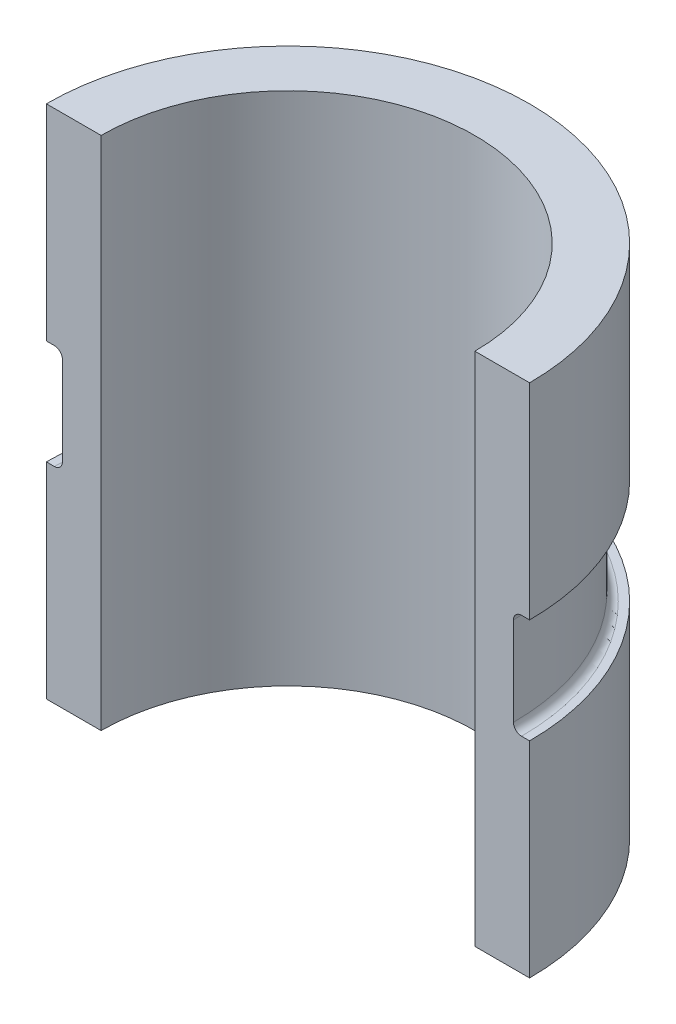
ISO-10303-21;
HEADER;
FILE_DESCRIPTION(('STEP AP214'),'2;1');
FILE_NAME('part.step','',(''),(''),'','','');
FILE_SCHEMA(('AUTOMOTIVE_DESIGN { 1 0 10303 214 1 1 1 1 }'));
ENDSEC;
DATA;
#1=APPLICATION_CONTEXT('core data for automotive mechanical design processes');
#2=APPLICATION_PROTOCOL_DEFINITION('international standard','automotive_design',2000,#1);
#3=PRODUCT_CONTEXT('',#1,'mechanical');
#4=PRODUCT('Part','Part','',(#3));
#5=PRODUCT_RELATED_PRODUCT_CATEGORY('part','',(#4));
#6=PRODUCT_DEFINITION_FORMATION('','',#4);
#7=PRODUCT_DEFINITION_CONTEXT('part definition',#1,'design');
#8=PRODUCT_DEFINITION('design','',#6,#7);
#9=PRODUCT_DEFINITION_SHAPE('','',#8);
#10=(LENGTH_UNIT() NAMED_UNIT(*) SI_UNIT(.MILLI.,.METRE.));
#11=(NAMED_UNIT(*) PLANE_ANGLE_UNIT() SI_UNIT($,.RADIAN.));
#12=(NAMED_UNIT(*) SI_UNIT($,.STERADIAN.) SOLID_ANGLE_UNIT());
#13=UNCERTAINTY_MEASURE_WITH_UNIT(LENGTH_MEASURE(1.E-05),#10,'distance_accuracy_value','');
#14=(GEOMETRIC_REPRESENTATION_CONTEXT(3) GLOBAL_UNCERTAINTY_ASSIGNED_CONTEXT((#13)) GLOBAL_UNIT_ASSIGNED_CONTEXT((#10,
#11,#12)) REPRESENTATION_CONTEXT('',''));
#15=CARTESIAN_POINT('',(0.,0.,0.));
#16=DIRECTION('',(0.,0.,1.));
#17=DIRECTION('',(1.,0.,0.));
#18=AXIS2_PLACEMENT_3D('',#15,#16,#17);
#19=CARTESIAN_POINT('',(0.,81.28,0.));
#20=DIRECTION('',(0.,-1.,0.));
#21=DIRECTION('',(0.,0.,-1.));
#22=AXIS2_PLACEMENT_3D('',#19,#20,#21);
#23=CYLINDRICAL_SURFACE('',#22,38.1);
#24=CARTESIAN_POINT('',(0.,48.895,0.));
#25=DIRECTION('',(0.,1.,0.));
#26=DIRECTION('',(0.,0.,1.));
#27=AXIS2_PLACEMENT_3D('',#24,#25,#26);
#28=CIRCLE('',#27,38.1);
#29=CARTESIAN_POINT('',(38.1,48.895,2.32211280229272E-13));
#30=VERTEX_POINT('',#29);
#31=CARTESIAN_POINT('',(-38.1,48.895,0.));
#32=VERTEX_POINT('',#31);
#33=EDGE_CURVE('E116',#30,#32,#28,.T.);
#34=ORIENTED_EDGE('',*,*,#33,.T.);
#35=DIRECTION('',(0.,-1.,0.));
#36=VECTOR('',#35,1.);
#37=CARTESIAN_POINT('',(-38.1,81.28,0.));
#38=LINE('',#37,#36);
#39=CARTESIAN_POINT('',(-38.1,81.28,0.));
#40=VERTEX_POINT('',#39);
#41=EDGE_CURVE('E130',#40,#32,#38,.T.);
#42=ORIENTED_EDGE('',*,*,#41,.F.);
#43=CARTESIAN_POINT('',(0.,81.28,0.));
#44=DIRECTION('',(0.,-1.,0.));
#45=DIRECTION('',(0.,0.,-1.));
#46=AXIS2_PLACEMENT_3D('',#43,#44,#45);
#47=CIRCLE('',#46,38.1);
#48=CARTESIAN_POINT('',(38.1,81.28,0.));
#49=VERTEX_POINT('',#48);
#50=EDGE_CURVE('E187',#40,#49,#47,.T.);
#51=ORIENTED_EDGE('',*,*,#50,.T.);
#52=DIRECTION('',(0.,-1.,0.));
#53=VECTOR('',#52,1.);
#54=CARTESIAN_POINT('',(38.1,81.28,0.));
#55=LINE('',#54,#53);
#56=EDGE_CURVE('E139',#49,#30,#55,.T.);
#57=ORIENTED_EDGE('',*,*,#56,.T.);
#58=EDGE_LOOP('',(#34,#42,#51,#57));
#59=FACE_BOUND('',#58,.T.);
#60=ADVANCED_FACE('F35',(#59),#23,.T.);
#61=CARTESIAN_POINT('',(-29.464,81.28,0.));
#62=DIRECTION('',(0.,0.,1.));
#63=DIRECTION('',(1.,0.,0.));
#64=AXIS2_PLACEMENT_3D('',#61,#62,#63);
#65=PLANE('',#64);
#66=DIRECTION('',(-1.,0.,0.));
#67=VECTOR('',#66,1.);
#68=CARTESIAN_POINT('',(-38.1,48.895,0.));
#69=LINE('',#68,#67);
#70=CARTESIAN_POINT('',(-36.83,48.895,0.));
#71=VERTEX_POINT('',#70);
#72=EDGE_CURVE('E173',#71,#32,#69,.T.);
#73=ORIENTED_EDGE('',*,*,#72,.F.);
#74=CARTESIAN_POINT('',(-36.83,47.625,0.));
#75=DIRECTION('',(0.,0.,1.));
#76=DIRECTION('',(1.,0.,0.));
#77=AXIS2_PLACEMENT_3D('',#74,#75,#76);
#78=CIRCLE('',#77,1.27);
#79=CARTESIAN_POINT('',(-35.56,47.625,0.));
#80=VERTEX_POINT('',#79);
#81=EDGE_CURVE('E151',#71,#80,#78,.F.);
#82=ORIENTED_EDGE('',*,*,#81,.T.);
#83=DIRECTION('',(0.,1.,0.));
#84=VECTOR('',#83,1.);
#85=CARTESIAN_POINT('',(-35.56,48.895,0.));
#86=LINE('',#85,#84);
#87=CARTESIAN_POINT('',(-35.56,33.655,0.));
#88=VERTEX_POINT('',#87);
#89=EDGE_CURVE('E124',#88,#80,#86,.T.);
#90=ORIENTED_EDGE('',*,*,#89,.F.);
#91=CARTESIAN_POINT('',(-36.83,33.655,0.));
#92=DIRECTION('',(0.,0.,1.));
#93=DIRECTION('',(1.,0.,0.));
#94=AXIS2_PLACEMENT_3D('',#91,#92,#93);
#95=CIRCLE('',#94,1.27);
#96=CARTESIAN_POINT('',(-36.83,32.385,0.));
#97=VERTEX_POINT('',#96);
#98=EDGE_CURVE('E43',#88,#97,#95,.F.);
#99=ORIENTED_EDGE('',*,*,#98,.T.);
#100=DIRECTION('',(1.,0.,0.));
#101=VECTOR('',#100,1.);
#102=CARTESIAN_POINT('',(-35.56,32.385,0.));
#103=LINE('',#102,#101);
#104=CARTESIAN_POINT('',(-38.1,32.385,0.));
#105=VERTEX_POINT('',#104);
#106=EDGE_CURVE('E111',#105,#97,#103,.T.);
#107=ORIENTED_EDGE('',*,*,#106,.F.);
#108=CARTESIAN_POINT('',(-38.1,0.,0.));
#109=VERTEX_POINT('',#108);
#110=EDGE_CURVE('E122',#105,#109,#38,.T.);
#111=ORIENTED_EDGE('',*,*,#110,.T.);
#112=DIRECTION('',(-1.,0.,0.));
#113=VECTOR('',#112,1.);
#114=CARTESIAN_POINT('',(-29.464,0.,0.));
#115=LINE('',#114,#113);
#116=CARTESIAN_POINT('',(-29.464,0.,0.));
#117=VERTEX_POINT('',#116);
#118=EDGE_CURVE('E183',#117,#109,#115,.T.);
#119=ORIENTED_EDGE('',*,*,#118,.F.);
#120=DIRECTION('',(0.,-1.,0.));
#121=VECTOR('',#120,1.);
#122=CARTESIAN_POINT('',(-29.464,81.28,0.));
#123=LINE('',#122,#121);
#124=CARTESIAN_POINT('',(-29.464,81.28,0.));
#125=VERTEX_POINT('',#124);
#126=EDGE_CURVE('E145',#125,#117,#123,.T.);
#127=ORIENTED_EDGE('',*,*,#126,.F.);
#128=DIRECTION('',(-1.,0.,0.));
#129=VECTOR('',#128,1.);
#130=CARTESIAN_POINT('',(-29.464,81.28,0.));
#131=LINE('',#130,#129);
#132=EDGE_CURVE('E184',#125,#40,#131,.T.);
#133=ORIENTED_EDGE('',*,*,#132,.T.);
#134=ORIENTED_EDGE('',*,*,#41,.T.);
#135=EDGE_LOOP('',(#73,#82,#90,#99,#107,#111,#119,#127,#133,#134));
#136=FACE_BOUND('',#135,.T.);
#137=ADVANCED_FACE('F120',(#136),#65,.T.);
#138=CARTESIAN_POINT('',(0.,81.28,0.));
#139=DIRECTION('',(0.,-1.,0.));
#140=DIRECTION('',(0.,0.,-1.));
#141=AXIS2_PLACEMENT_3D('',#138,#139,#140);
#142=CYLINDRICAL_SURFACE('',#141,29.464);
#143=CARTESIAN_POINT('',(0.,0.,0.));
#144=DIRECTION('',(0.,-1.,0.));
#145=DIRECTION('',(0.,0.,-1.));
#146=AXIS2_PLACEMENT_3D('',#143,#144,#145);
#147=CIRCLE('',#146,29.464);
#148=CARTESIAN_POINT('',(29.464,0.,0.));
#149=VERTEX_POINT('',#148);
#150=EDGE_CURVE('E188',#117,#149,#147,.T.);
#151=ORIENTED_EDGE('',*,*,#150,.T.);
#152=DIRECTION('',(0.,-1.,0.));
#153=VECTOR('',#152,1.);
#154=CARTESIAN_POINT('',(29.464,81.28,0.));
#155=LINE('',#154,#153);
#156=CARTESIAN_POINT('',(29.464,81.28,0.));
#157=VERTEX_POINT('',#156);
#158=EDGE_CURVE('E198',#157,#149,#155,.T.);
#159=ORIENTED_EDGE('',*,*,#158,.F.);
#160=CARTESIAN_POINT('',(0.,81.28,0.));
#161=DIRECTION('',(0.,-1.,0.));
#162=DIRECTION('',(0.,0.,-1.));
#163=AXIS2_PLACEMENT_3D('',#160,#161,#162);
#164=CIRCLE('',#163,29.464);
#165=EDGE_CURVE('E131',#125,#157,#164,.T.);
#166=ORIENTED_EDGE('',*,*,#165,.F.);
#167=ORIENTED_EDGE('',*,*,#126,.T.);
#168=EDGE_LOOP('',(#151,#159,#166,#167));
#169=FACE_BOUND('',#168,.T.);
#170=ADVANCED_FACE('F210',(#169),#142,.F.);
#171=CARTESIAN_POINT('',(29.464,81.28,0.));
#172=DIRECTION('',(0.,0.,-1.));
#173=DIRECTION('',(-1.,0.,0.));
#174=AXIS2_PLACEMENT_3D('',#171,#172,#173);
#175=PLANE('',#174);
#176=DIRECTION('',(-1.,0.,0.));
#177=VECTOR('',#176,1.);
#178=CARTESIAN_POINT('',(35.56,32.385,2.16730528213987E-13));
#179=LINE('',#178,#177);
#180=CARTESIAN_POINT('',(38.1,32.385,0.));
#181=VERTEX_POINT('',#180);
#182=CARTESIAN_POINT('',(36.83,32.385,2.2447090422163E-13));
#183=VERTEX_POINT('',#182);
#184=EDGE_CURVE('E112',#181,#183,#179,.T.);
#185=ORIENTED_EDGE('',*,*,#184,.T.);
#186=CARTESIAN_POINT('',(36.83,33.655,0.));
#187=DIRECTION('',(0.,0.,-1.));
#188=DIRECTION('',(-1.,0.,0.));
#189=AXIS2_PLACEMENT_3D('',#186,#187,#188);
#190=CIRCLE('',#189,1.27);
#191=CARTESIAN_POINT('',(35.56,33.655,2.16730528213987E-13));
#192=VERTEX_POINT('',#191);
#193=EDGE_CURVE('E11',#183,#192,#190,.T.);
#194=ORIENTED_EDGE('',*,*,#193,.T.);
#195=DIRECTION('',(0.,1.,0.));
#196=VECTOR('',#195,1.);
#197=CARTESIAN_POINT('',(35.56,48.895,2.16730528213987E-13));
#198=LINE('',#197,#196);
#199=CARTESIAN_POINT('',(35.56,47.625,2.16730528213987E-13));
#200=VERTEX_POINT('',#199);
#201=EDGE_CURVE('E162',#192,#200,#198,.T.);
#202=ORIENTED_EDGE('',*,*,#201,.T.);
#203=CARTESIAN_POINT('',(36.83,47.625,0.));
#204=DIRECTION('',(0.,0.,-1.));
#205=DIRECTION('',(-1.,0.,0.));
#206=AXIS2_PLACEMENT_3D('',#203,#204,#205);
#207=CIRCLE('',#206,1.27);
#208=CARTESIAN_POINT('',(36.83,48.895,2.2447090422163E-13));
#209=VERTEX_POINT('',#208);
#210=EDGE_CURVE('E153',#200,#209,#207,.T.);
#211=ORIENTED_EDGE('',*,*,#210,.T.);
#212=DIRECTION('',(1.,0.,0.));
#213=VECTOR('',#212,1.);
#214=CARTESIAN_POINT('',(38.1,48.895,2.32211280229272E-13));
#215=LINE('',#214,#213);
#216=EDGE_CURVE('E117',#209,#30,#215,.T.);
#217=ORIENTED_EDGE('',*,*,#216,.T.);
#218=ORIENTED_EDGE('',*,*,#56,.F.);
#219=DIRECTION('',(1.,0.,0.));
#220=VECTOR('',#219,1.);
#221=CARTESIAN_POINT('',(29.464,81.28,0.));
#222=LINE('',#221,#220);
#223=EDGE_CURVE('E135',#157,#49,#222,.T.);
#224=ORIENTED_EDGE('',*,*,#223,.F.);
#225=ORIENTED_EDGE('',*,*,#158,.T.);
#226=DIRECTION('',(1.,0.,0.));
#227=VECTOR('',#226,1.);
#228=CARTESIAN_POINT('',(29.464,0.,0.));
#229=LINE('',#228,#227);
#230=CARTESIAN_POINT('',(38.1,0.,0.));
#231=VERTEX_POINT('',#230);
#232=EDGE_CURVE('E194',#149,#231,#229,.T.);
#233=ORIENTED_EDGE('',*,*,#232,.T.);
#234=EDGE_CURVE('E134',#181,#231,#55,.T.);
#235=ORIENTED_EDGE('',*,*,#234,.F.);
#236=EDGE_LOOP('',(#185,#194,#202,#211,#217,#218,#224,#225,#233,#235));
#237=FACE_BOUND('',#236,.T.);
#238=ADVANCED_FACE('F158',(#237),#175,.F.);
#239=CARTESIAN_POINT('',(0.,32.385,0.));
#240=DIRECTION('',(0.,1.,0.));
#241=DIRECTION('',(0.,0.,1.));
#242=AXIS2_PLACEMENT_3D('',#239,#240,#241);
#243=CIRCLE('',#242,38.1);
#244=EDGE_CURVE('E109',#181,#105,#243,.T.);
#245=ORIENTED_EDGE('',*,*,#244,.F.);
#246=ORIENTED_EDGE('',*,*,#234,.T.);
#247=CARTESIAN_POINT('',(0.,0.,0.));
#248=DIRECTION('',(0.,-1.,0.));
#249=DIRECTION('',(0.,0.,-1.));
#250=AXIS2_PLACEMENT_3D('',#247,#248,#249);
#251=CIRCLE('',#250,38.1);
#252=EDGE_CURVE('E128',#109,#231,#251,.T.);
#253=ORIENTED_EDGE('',*,*,#252,.F.);
#254=ORIENTED_EDGE('',*,*,#110,.F.);
#255=EDGE_LOOP('',(#245,#246,#253,#254));
#256=FACE_BOUND('',#255,.T.);
#257=ADVANCED_FACE('F126',(#256),#23,.T.);
#258=CARTESIAN_POINT('',(0.,81.28,0.));
#259=DIRECTION('',(0.,-1.,0.));
#260=DIRECTION('',(0.,0.,-1.));
#261=AXIS2_PLACEMENT_3D('',#258,#259,#260);
#262=PLANE('',#261);
#263=ORIENTED_EDGE('',*,*,#132,.F.);
#264=ORIENTED_EDGE('',*,*,#165,.T.);
#265=ORIENTED_EDGE('',*,*,#223,.T.);
#266=ORIENTED_EDGE('',*,*,#50,.F.);
#267=EDGE_LOOP('',(#263,#264,#265,#266));
#268=FACE_BOUND('',#267,.T.);
#269=ADVANCED_FACE('F213',(#268),#262,.F.);
#270=CARTESIAN_POINT('',(0.,0.,0.));
#271=DIRECTION('',(0.,-1.,0.));
#272=DIRECTION('',(0.,0.,-1.));
#273=AXIS2_PLACEMENT_3D('',#270,#271,#272);
#274=PLANE('',#273);
#275=ORIENTED_EDGE('',*,*,#118,.T.);
#276=ORIENTED_EDGE('',*,*,#252,.T.);
#277=ORIENTED_EDGE('',*,*,#232,.F.);
#278=ORIENTED_EDGE('',*,*,#150,.F.);
#279=EDGE_LOOP('',(#275,#276,#277,#278));
#280=FACE_BOUND('',#279,.T.);
#281=ADVANCED_FACE('F206',(#280),#274,.T.);
#282=CARTESIAN_POINT('',(38.1,48.895,2.32211280229272E-13));
#283=DIRECTION('',(0.,1.,0.));
#284=DIRECTION('',(0.,0.,1.));
#285=AXIS2_PLACEMENT_3D('',#282,#283,#284);
#286=PLANE('',#285);
#287=ORIENTED_EDGE('',*,*,#216,.F.);
#288=CARTESIAN_POINT('',(0.,48.895,0.));
#289=DIRECTION('',(0.,1.,0.));
#290=DIRECTION('',(0.,0.,1.));
#291=AXIS2_PLACEMENT_3D('',#288,#289,#290);
#292=CIRCLE('',#291,36.83);
#293=EDGE_CURVE('E141',#209,#71,#292,.T.);
#294=ORIENTED_EDGE('',*,*,#293,.T.);
#295=ORIENTED_EDGE('',*,*,#72,.T.);
#296=ORIENTED_EDGE('',*,*,#33,.F.);
#297=EDGE_LOOP('',(#287,#294,#295,#296));
#298=FACE_BOUND('',#297,.T.);
#299=ADVANCED_FACE('F167',(#298),#286,.F.);
#300=CARTESIAN_POINT('',(0.,0.,0.));
#301=DIRECTION('',(0.,1.,0.));
#302=DIRECTION('',(0.,0.,1.));
#303=AXIS2_PLACEMENT_3D('',#300,#301,#302);
#304=CYLINDRICAL_SURFACE('',#303,35.56);
#305=ORIENTED_EDGE('',*,*,#89,.T.);
#306=CARTESIAN_POINT('',(0.,47.625,0.));
#307=DIRECTION('',(0.,1.,0.));
#308=DIRECTION('',(0.,0.,1.));
#309=AXIS2_PLACEMENT_3D('',#306,#307,#308);
#310=CIRCLE('',#309,35.56);
#311=EDGE_CURVE('E148',#80,#200,#310,.F.);
#312=ORIENTED_EDGE('',*,*,#311,.T.);
#313=ORIENTED_EDGE('',*,*,#201,.F.);
#314=CARTESIAN_POINT('',(0.,33.655,0.));
#315=DIRECTION('',(0.,-1.,0.));
#316=DIRECTION('',(0.,0.,-1.));
#317=AXIS2_PLACEMENT_3D('',#314,#315,#316);
#318=CIRCLE('',#317,35.56);
#319=EDGE_CURVE('E144',#192,#88,#318,.F.);
#320=ORIENTED_EDGE('',*,*,#319,.T.);
#321=EDGE_LOOP('',(#305,#312,#313,#320));
#322=FACE_BOUND('',#321,.T.);
#323=ADVANCED_FACE('F175',(#322),#304,.T.);
#324=CARTESIAN_POINT('',(35.56,32.385,2.16730528213987E-13));
#325=DIRECTION('',(0.,-1.,0.));
#326=DIRECTION('',(0.,0.,-1.));
#327=AXIS2_PLACEMENT_3D('',#324,#325,#326);
#328=PLANE('',#327);
#329=ORIENTED_EDGE('',*,*,#106,.T.);
#330=CARTESIAN_POINT('',(0.,32.385,0.));
#331=DIRECTION('',(0.,-1.,0.));
#332=DIRECTION('',(0.,0.,-1.));
#333=AXIS2_PLACEMENT_3D('',#330,#331,#332);
#334=CIRCLE('',#333,36.83);
#335=EDGE_CURVE('E56',#97,#183,#334,.T.);
#336=ORIENTED_EDGE('',*,*,#335,.T.);
#337=ORIENTED_EDGE('',*,*,#184,.F.);
#338=ORIENTED_EDGE('',*,*,#244,.T.);
#339=EDGE_LOOP('',(#329,#336,#337,#338));
#340=FACE_BOUND('',#339,.T.);
#341=ADVANCED_FACE('F110',(#340),#328,.F.);
#342=CARTESIAN_POINT('',(0.,47.625,0.));
#343=DIRECTION('',(0.,1.,0.));
#344=DIRECTION('',(0.,0.,1.));
#345=AXIS2_PLACEMENT_3D('',#342,#343,#344);
#346=TOROIDAL_SURFACE('',#345,36.83,1.27);
#347=ORIENTED_EDGE('',*,*,#210,.F.);
#348=ORIENTED_EDGE('',*,*,#311,.F.);
#349=ORIENTED_EDGE('',*,*,#81,.F.);
#350=ORIENTED_EDGE('',*,*,#293,.F.);
#351=EDGE_LOOP('',(#347,#348,#349,#350));
#352=FACE_BOUND('',#351,.T.);
#353=ADVANCED_FACE('F171',(#352),#346,.F.);
#354=CARTESIAN_POINT('',(0.,33.655,0.));
#355=DIRECTION('',(0.,-1.,0.));
#356=DIRECTION('',(0.,0.,-1.));
#357=AXIS2_PLACEMENT_3D('',#354,#355,#356);
#358=TOROIDAL_SURFACE('',#357,36.83,1.27);
#359=ORIENTED_EDGE('',*,*,#193,.F.);
#360=ORIENTED_EDGE('',*,*,#335,.F.);
#361=ORIENTED_EDGE('',*,*,#98,.F.);
#362=ORIENTED_EDGE('',*,*,#319,.F.);
#363=EDGE_LOOP('',(#359,#360,#361,#362));
#364=FACE_BOUND('',#363,.T.);
#365=ADVANCED_FACE('F37',(#364),#358,.F.);
#366=CLOSED_SHELL('',(#60,#137,#170,#238,#257,#269,#281,#299,#323,#341,#353,#365));
#367=MANIFOLD_SOLID_BREP('B2',#366);
#368=ADVANCED_BREP_SHAPE_REPRESENTATION('',(#18,#367),#14);
#369=SHAPE_DEFINITION_REPRESENTATION(#9,#368);
ENDSEC;
END-ISO-10303-21;
